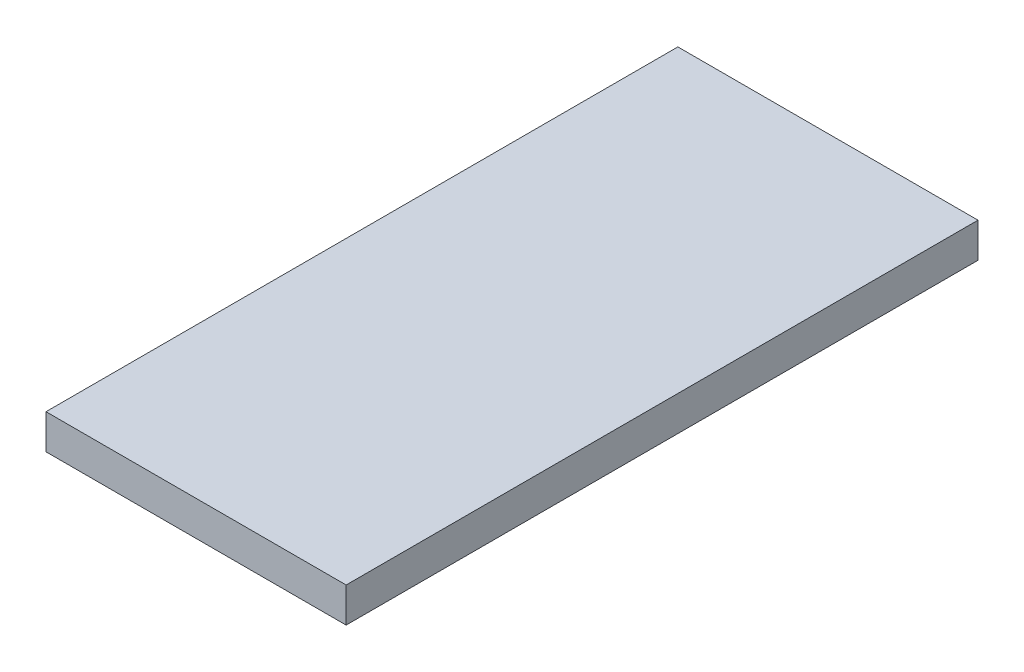
ISO-10303-21;
HEADER;
FILE_DESCRIPTION(('STEP AP214'),'2;1');
FILE_NAME('part.step','',(''),(''),'','','');
FILE_SCHEMA(('AUTOMOTIVE_DESIGN { 1 0 10303 214 1 1 1 1 }'));
ENDSEC;
DATA;
#1=APPLICATION_CONTEXT('core data for automotive mechanical design processes');
#2=APPLICATION_PROTOCOL_DEFINITION('international standard','automotive_design',2000,#1);
#3=PRODUCT_CONTEXT('',#1,'mechanical');
#4=PRODUCT('Part','Part','',(#3));
#5=PRODUCT_RELATED_PRODUCT_CATEGORY('part','',(#4));
#6=PRODUCT_DEFINITION_FORMATION('','',#4);
#7=PRODUCT_DEFINITION_CONTEXT('part definition',#1,'design');
#8=PRODUCT_DEFINITION('design','',#6,#7);
#9=PRODUCT_DEFINITION_SHAPE('','',#8);
#10=(LENGTH_UNIT() NAMED_UNIT(*) SI_UNIT(.MILLI.,.METRE.));
#11=(NAMED_UNIT(*) PLANE_ANGLE_UNIT() SI_UNIT($,.RADIAN.));
#12=(NAMED_UNIT(*) SI_UNIT($,.STERADIAN.) SOLID_ANGLE_UNIT());
#13=UNCERTAINTY_MEASURE_WITH_UNIT(LENGTH_MEASURE(1.E-05),#10,'distance_accuracy_value','');
#14=(GEOMETRIC_REPRESENTATION_CONTEXT(3) GLOBAL_UNCERTAINTY_ASSIGNED_CONTEXT((#13)) GLOBAL_UNIT_ASSIGNED_CONTEXT((#10,
#11,#12)) REPRESENTATION_CONTEXT('',''));
#15=CARTESIAN_POINT('',(0.,0.,0.));
#16=DIRECTION('',(0.,0.,1.));
#17=DIRECTION('',(1.,0.,0.));
#18=AXIS2_PLACEMENT_3D('',#15,#16,#17);
#19=CARTESIAN_POINT('',(9.5,-1.1,40.));
#20=DIRECTION('',(-1.,0.,0.));
#21=DIRECTION('',(0.,0.,1.));
#22=AXIS2_PLACEMENT_3D('',#19,#20,#21);
#23=PLANE('',#22);
#24=DIRECTION('',(0.,1.,0.));
#25=VECTOR('',#24,1.);
#26=CARTESIAN_POINT('',(9.5,-1.1,0.));
#27=LINE('',#26,#25);
#28=CARTESIAN_POINT('',(9.5,-1.1,0.));
#29=VERTEX_POINT('',#28);
#30=CARTESIAN_POINT('',(9.5,1.1,0.));
#31=VERTEX_POINT('',#30);
#32=EDGE_CURVE('E98',#29,#31,#27,.T.);
#33=ORIENTED_EDGE('',*,*,#32,.T.);
#34=DIRECTION('',(0.,0.,-1.));
#35=VECTOR('',#34,1.);
#36=CARTESIAN_POINT('',(9.5,1.1,40.));
#37=LINE('',#36,#35);
#38=CARTESIAN_POINT('',(9.5,1.1,40.));
#39=VERTEX_POINT('',#38);
#40=EDGE_CURVE('E11',#39,#31,#37,.T.);
#41=ORIENTED_EDGE('',*,*,#40,.F.);
#42=DIRECTION('',(0.,1.,0.));
#43=VECTOR('',#42,1.);
#44=CARTESIAN_POINT('',(9.5,-1.1,40.));
#45=LINE('',#44,#43);
#46=CARTESIAN_POINT('',(9.5,-1.1,40.));
#47=VERTEX_POINT('',#46);
#48=EDGE_CURVE('E86',#47,#39,#45,.T.);
#49=ORIENTED_EDGE('',*,*,#48,.F.);
#50=DIRECTION('',(0.,0.,-1.));
#51=VECTOR('',#50,1.);
#52=CARTESIAN_POINT('',(9.5,-1.1,40.));
#53=LINE('',#52,#51);
#54=EDGE_CURVE('E94',#47,#29,#53,.T.);
#55=ORIENTED_EDGE('',*,*,#54,.T.);
#56=EDGE_LOOP('',(#33,#41,#49,#55));
#57=FACE_BOUND('',#56,.T.);
#58=ADVANCED_FACE('F35',(#57),#23,.F.);
#59=CARTESIAN_POINT('',(-9.5,1.1,40.));
#60=DIRECTION('',(0.,-1.,0.));
#61=DIRECTION('',(0.,0.,-1.));
#62=AXIS2_PLACEMENT_3D('',#59,#60,#61);
#63=PLANE('',#62);
#64=DIRECTION('',(-1.,0.,0.));
#65=VECTOR('',#64,1.);
#66=CARTESIAN_POINT('',(-9.5,1.1,0.));
#67=LINE('',#66,#65);
#68=CARTESIAN_POINT('',(-9.5,1.1,0.));
#69=VERTEX_POINT('',#68);
#70=EDGE_CURVE('E90',#31,#69,#67,.T.);
#71=ORIENTED_EDGE('',*,*,#70,.T.);
#72=DIRECTION('',(0.,0.,-1.));
#73=VECTOR('',#72,1.);
#74=CARTESIAN_POINT('',(-9.5,1.1,40.));
#75=LINE('',#74,#73);
#76=CARTESIAN_POINT('',(-9.5,1.1,40.));
#77=VERTEX_POINT('',#76);
#78=EDGE_CURVE('E43',#77,#69,#75,.T.);
#79=ORIENTED_EDGE('',*,*,#78,.F.);
#80=DIRECTION('',(-1.,0.,0.));
#81=VECTOR('',#80,1.);
#82=CARTESIAN_POINT('',(-9.5,1.1,40.));
#83=LINE('',#82,#81);
#84=EDGE_CURVE('E81',#39,#77,#83,.T.);
#85=ORIENTED_EDGE('',*,*,#84,.F.);
#86=ORIENTED_EDGE('',*,*,#40,.T.);
#87=EDGE_LOOP('',(#71,#79,#85,#86));
#88=FACE_BOUND('',#87,.T.);
#89=ADVANCED_FACE('F89',(#88),#63,.F.);
#90=CARTESIAN_POINT('',(-9.5,-1.1,40.));
#91=DIRECTION('',(1.,0.,0.));
#92=DIRECTION('',(0.,0.,-1.));
#93=AXIS2_PLACEMENT_3D('',#90,#91,#92);
#94=PLANE('',#93);
#95=DIRECTION('',(0.,-1.,0.));
#96=VECTOR('',#95,1.);
#97=CARTESIAN_POINT('',(-9.5,-1.1,0.));
#98=LINE('',#97,#96);
#99=CARTESIAN_POINT('',(-9.5,-1.1,0.));
#100=VERTEX_POINT('',#99);
#101=EDGE_CURVE('E68',#69,#100,#98,.T.);
#102=ORIENTED_EDGE('',*,*,#101,.T.);
#103=DIRECTION('',(0.,0.,-1.));
#104=VECTOR('',#103,1.);
#105=CARTESIAN_POINT('',(-9.5,-1.1,40.));
#106=LINE('',#105,#104);
#107=CARTESIAN_POINT('',(-9.5,-1.1,40.));
#108=VERTEX_POINT('',#107);
#109=EDGE_CURVE('E91',#108,#100,#106,.T.);
#110=ORIENTED_EDGE('',*,*,#109,.F.);
#111=DIRECTION('',(0.,-1.,0.));
#112=VECTOR('',#111,1.);
#113=CARTESIAN_POINT('',(-9.5,-1.1,40.));
#114=LINE('',#113,#112);
#115=EDGE_CURVE('E84',#77,#108,#114,.T.);
#116=ORIENTED_EDGE('',*,*,#115,.F.);
#117=ORIENTED_EDGE('',*,*,#78,.T.);
#118=EDGE_LOOP('',(#102,#110,#116,#117));
#119=FACE_BOUND('',#118,.T.);
#120=ADVANCED_FACE('F92',(#119),#94,.F.);
#121=CARTESIAN_POINT('',(-9.5,-1.1,40.));
#122=DIRECTION('',(0.,1.,0.));
#123=DIRECTION('',(0.,0.,1.));
#124=AXIS2_PLACEMENT_3D('',#121,#122,#123);
#125=PLANE('',#124);
#126=DIRECTION('',(1.,0.,0.));
#127=VECTOR('',#126,1.);
#128=CARTESIAN_POINT('',(-9.5,-1.1,0.));
#129=LINE('',#128,#127);
#130=EDGE_CURVE('E74',#100,#29,#129,.T.);
#131=ORIENTED_EDGE('',*,*,#130,.T.);
#132=ORIENTED_EDGE('',*,*,#54,.F.);
#133=DIRECTION('',(1.,0.,0.));
#134=VECTOR('',#133,1.);
#135=CARTESIAN_POINT('',(-9.5,-1.1,40.));
#136=LINE('',#135,#134);
#137=EDGE_CURVE('E51',#108,#47,#136,.T.);
#138=ORIENTED_EDGE('',*,*,#137,.F.);
#139=ORIENTED_EDGE('',*,*,#109,.T.);
#140=EDGE_LOOP('',(#131,#132,#138,#139));
#141=FACE_BOUND('',#140,.T.);
#142=ADVANCED_FACE('F105',(#141),#125,.F.);
#143=CARTESIAN_POINT('',(0.,0.,40.));
#144=DIRECTION('',(0.,0.,-1.));
#145=DIRECTION('',(-1.,0.,0.));
#146=AXIS2_PLACEMENT_3D('',#143,#144,#145);
#147=PLANE('',#146);
#148=ORIENTED_EDGE('',*,*,#48,.T.);
#149=ORIENTED_EDGE('',*,*,#84,.T.);
#150=ORIENTED_EDGE('',*,*,#115,.T.);
#151=ORIENTED_EDGE('',*,*,#137,.T.);
#152=EDGE_LOOP('',(#148,#149,#150,#151));
#153=FACE_BOUND('',#152,.T.);
#154=ADVANCED_FACE('F82',(#153),#147,.F.);
#155=CARTESIAN_POINT('',(0.,0.,0.));
#156=DIRECTION('',(0.,0.,-1.));
#157=DIRECTION('',(-1.,0.,0.));
#158=AXIS2_PLACEMENT_3D('',#155,#156,#157);
#159=PLANE('',#158);
#160=ORIENTED_EDGE('',*,*,#32,.F.);
#161=ORIENTED_EDGE('',*,*,#130,.F.);
#162=ORIENTED_EDGE('',*,*,#101,.F.);
#163=ORIENTED_EDGE('',*,*,#70,.F.);
#164=EDGE_LOOP('',(#160,#161,#162,#163));
#165=FACE_BOUND('',#164,.T.);
#166=ADVANCED_FACE('F108',(#165),#159,.T.);
#167=CLOSED_SHELL('',(#58,#89,#120,#142,#154,#166));
#168=MANIFOLD_SOLID_BREP('B2',#167);
#169=ADVANCED_BREP_SHAPE_REPRESENTATION('',(#18,#168),#14);
#170=SHAPE_DEFINITION_REPRESENTATION(#9,#169);
ENDSEC;
END-ISO-10303-21;
